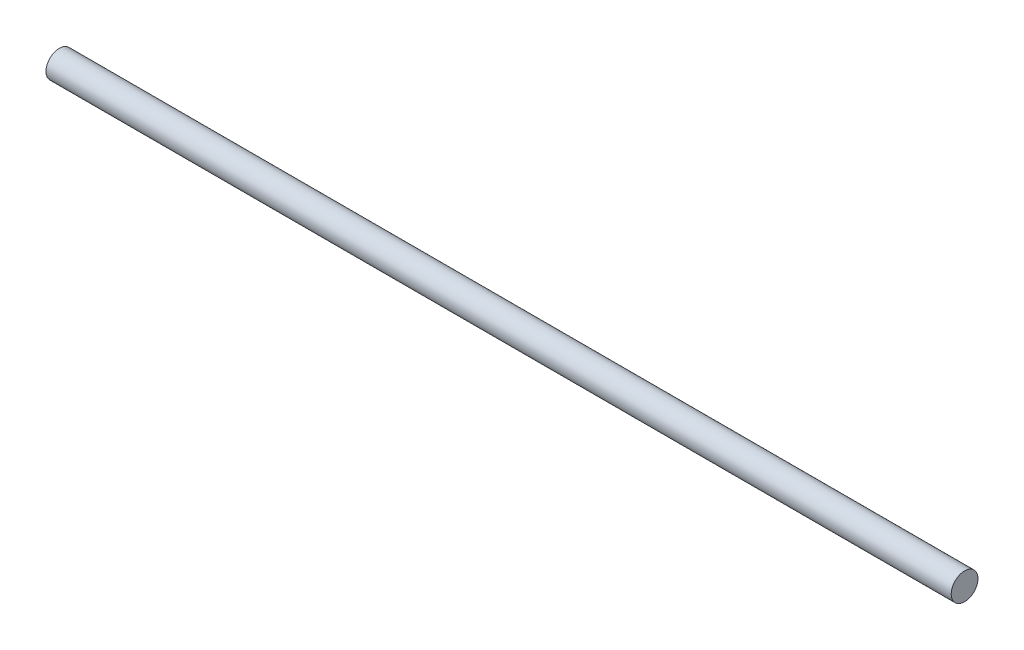
ISO-10303-21;
HEADER;
FILE_DESCRIPTION(('STEP AP214'),'2;1');
FILE_NAME('part.step','',(''),(''),'','','');
FILE_SCHEMA(('AUTOMOTIVE_DESIGN { 1 0 10303 214 1 1 1 1 }'));
ENDSEC;
DATA;
#1=APPLICATION_CONTEXT('core data for automotive mechanical design processes');
#2=APPLICATION_PROTOCOL_DEFINITION('international standard','automotive_design',2000,#1);
#3=PRODUCT_CONTEXT('',#1,'mechanical');
#4=PRODUCT('Part','Part','',(#3));
#5=PRODUCT_RELATED_PRODUCT_CATEGORY('part','',(#4));
#6=PRODUCT_DEFINITION_FORMATION('','',#4);
#7=PRODUCT_DEFINITION_CONTEXT('part definition',#1,'design');
#8=PRODUCT_DEFINITION('design','',#6,#7);
#9=PRODUCT_DEFINITION_SHAPE('','',#8);
#10=(LENGTH_UNIT() NAMED_UNIT(*) SI_UNIT(.MILLI.,.METRE.));
#11=(NAMED_UNIT(*) PLANE_ANGLE_UNIT() SI_UNIT($,.RADIAN.));
#12=(NAMED_UNIT(*) SI_UNIT($,.STERADIAN.) SOLID_ANGLE_UNIT());
#13=UNCERTAINTY_MEASURE_WITH_UNIT(LENGTH_MEASURE(1.E-05),#10,'distance_accuracy_value','');
#14=(GEOMETRIC_REPRESENTATION_CONTEXT(3) GLOBAL_UNCERTAINTY_ASSIGNED_CONTEXT((#13)) GLOBAL_UNIT_ASSIGNED_CONTEXT((#10,
#11,#12)) REPRESENTATION_CONTEXT('',''));
#15=CARTESIAN_POINT('',(0.,0.,0.));
#16=DIRECTION('',(0.,0.,1.));
#17=DIRECTION('',(1.,0.,0.));
#18=AXIS2_PLACEMENT_3D('',#15,#16,#17);
#19=CARTESIAN_POINT('',(482.6,0.,0.));
#20=DIRECTION('',(-1.,0.,0.));
#21=DIRECTION('',(0.,0.,1.));
#22=AXIS2_PLACEMENT_3D('',#19,#20,#21);
#23=CYLINDRICAL_SURFACE('',#22,14.2875);
#24=CARTESIAN_POINT('',(482.6,0.,0.));
#25=DIRECTION('',(1.,0.,0.));
#26=DIRECTION('',(0.,0.,-1.));
#27=AXIS2_PLACEMENT_3D('',#24,#25,#26);
#28=CIRCLE('',#27,14.2875);
#29=CARTESIAN_POINT('',(482.6,0.,-14.2875));
#30=VERTEX_POINT('',#29);
#31=EDGE_CURVE('E10',#30,#30,#28,.T.);
#32=ORIENTED_EDGE('',*,*,#31,.F.);
#33=EDGE_LOOP('',(#32));
#34=FACE_BOUND('',#33,.T.);
#35=CARTESIAN_POINT('',(-482.6,0.,0.));
#36=DIRECTION('',(1.,0.,0.));
#37=DIRECTION('',(0.,0.,-1.));
#38=AXIS2_PLACEMENT_3D('',#35,#36,#37);
#39=CIRCLE('',#38,14.2875);
#40=CARTESIAN_POINT('',(-482.6,0.,-14.2875));
#41=VERTEX_POINT('',#40);
#42=EDGE_CURVE('E33',#41,#41,#39,.T.);
#43=ORIENTED_EDGE('',*,*,#42,.T.);
#44=EDGE_LOOP('',(#43));
#45=FACE_BOUND('',#44,.T.);
#46=ADVANCED_FACE('F30',(#34,#45),#23,.T.);
#47=CARTESIAN_POINT('',(482.6,0.,0.));
#48=DIRECTION('',(1.,0.,0.));
#49=DIRECTION('',(0.,0.,-1.));
#50=AXIS2_PLACEMENT_3D('',#47,#48,#49);
#51=PLANE('',#50);
#52=ORIENTED_EDGE('',*,*,#31,.T.);
#53=EDGE_LOOP('',(#52));
#54=FACE_BOUND('',#53,.T.);
#55=ADVANCED_FACE('F45',(#54),#51,.T.);
#56=CARTESIAN_POINT('',(-482.6,0.,0.));
#57=DIRECTION('',(1.,0.,0.));
#58=DIRECTION('',(0.,0.,-1.));
#59=AXIS2_PLACEMENT_3D('',#56,#57,#58);
#60=PLANE('',#59);
#61=ORIENTED_EDGE('',*,*,#42,.F.);
#62=EDGE_LOOP('',(#61));
#63=FACE_BOUND('',#62,.T.);
#64=ADVANCED_FACE('F43',(#63),#60,.F.);
#65=CLOSED_SHELL('',(#46,#55,#64));
#66=MANIFOLD_SOLID_BREP('B2',#65);
#67=ADVANCED_BREP_SHAPE_REPRESENTATION('',(#18,#66),#14);
#68=SHAPE_DEFINITION_REPRESENTATION(#9,#67);
ENDSEC;
END-ISO-10303-21;
